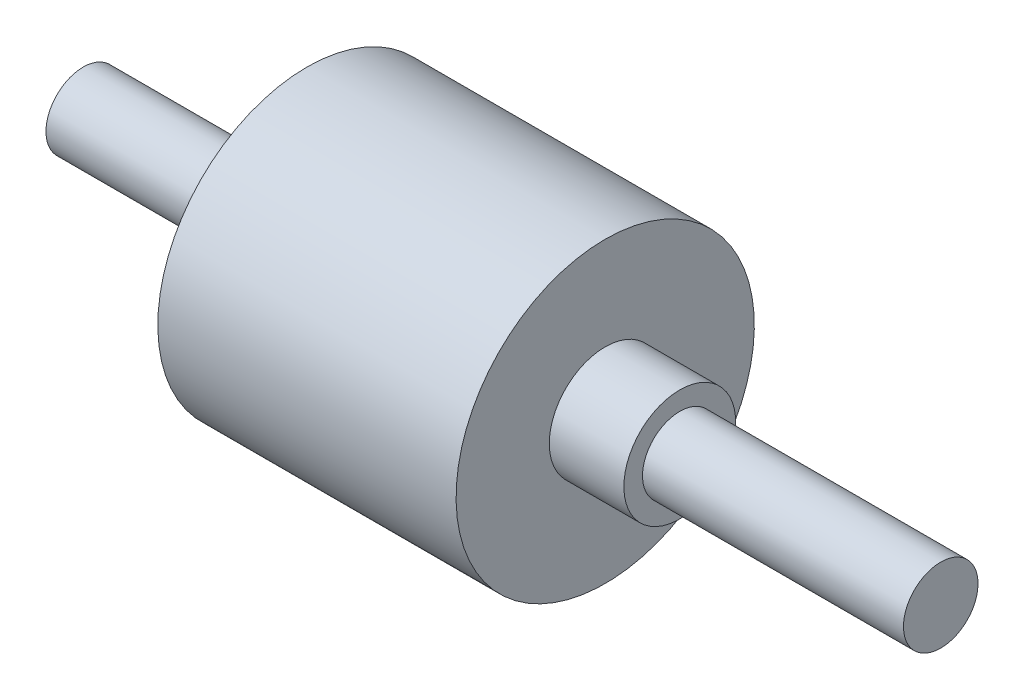
ISO-10303-21;
HEADER;
FILE_DESCRIPTION(('STEP AP214'),'2;1');
FILE_NAME('part.step','',(''),(''),'','','');
FILE_SCHEMA(('AUTOMOTIVE_DESIGN { 1 0 10303 214 1 1 1 1 }'));
ENDSEC;
DATA;
#1=APPLICATION_CONTEXT('core data for automotive mechanical design processes');
#2=APPLICATION_PROTOCOL_DEFINITION('international standard','automotive_design',2000,#1);
#3=PRODUCT_CONTEXT('',#1,'mechanical');
#4=PRODUCT('Part','Part','',(#3));
#5=PRODUCT_RELATED_PRODUCT_CATEGORY('part','',(#4));
#6=PRODUCT_DEFINITION_FORMATION('','',#4);
#7=PRODUCT_DEFINITION_CONTEXT('part definition',#1,'design');
#8=PRODUCT_DEFINITION('design','',#6,#7);
#9=PRODUCT_DEFINITION_SHAPE('','',#8);
#10=(LENGTH_UNIT() NAMED_UNIT(*) SI_UNIT(.MILLI.,.METRE.));
#11=(NAMED_UNIT(*) PLANE_ANGLE_UNIT() SI_UNIT($,.RADIAN.));
#12=(NAMED_UNIT(*) SI_UNIT($,.STERADIAN.) SOLID_ANGLE_UNIT());
#13=UNCERTAINTY_MEASURE_WITH_UNIT(LENGTH_MEASURE(1.E-05),#10,'distance_accuracy_value','');
#14=(GEOMETRIC_REPRESENTATION_CONTEXT(3) GLOBAL_UNCERTAINTY_ASSIGNED_CONTEXT((#13)) GLOBAL_UNIT_ASSIGNED_CONTEXT((#10,
#11,#12)) REPRESENTATION_CONTEXT('',''));
#15=CARTESIAN_POINT('',(0.,0.,0.));
#16=DIRECTION('',(0.,0.,1.));
#17=DIRECTION('',(1.,0.,0.));
#18=AXIS2_PLACEMENT_3D('',#15,#16,#17);
#19=CARTESIAN_POINT('',(57.5,5.,0.));
#20=DIRECTION('',(1.,0.,0.));
#21=DIRECTION('',(0.,1.,0.));
#22=AXIS2_PLACEMENT_3D('',#19,#20,#21);
#23=PLANE('',#22);
#24=CARTESIAN_POINT('',(57.5,0.,0.));
#25=DIRECTION('',(1.,0.,0.));
#26=DIRECTION('',(0.,1.,0.));
#27=AXIS2_PLACEMENT_3D('',#24,#25,#26);
#28=CIRCLE('',#27,4.99999999999998);
#29=CARTESIAN_POINT('',(57.5,5.,0.));
#30=VERTEX_POINT('',#29);
#31=EDGE_CURVE('E76',#30,#30,#28,.T.);
#32=ORIENTED_EDGE('',*,*,#31,.T.);
#33=EDGE_LOOP('',(#32));
#34=FACE_BOUND('',#33,.T.);
#35=ADVANCED_FACE('F41',(#34),#23,.T.);
#36=CARTESIAN_POINT('',(-57.5,0.,0.));
#37=DIRECTION('',(-1.,0.,0.));
#38=DIRECTION('',(0.,-1.,0.));
#39=AXIS2_PLACEMENT_3D('',#36,#37,#38);
#40=PLANE('',#39);
#41=CARTESIAN_POINT('',(-57.5,0.,0.));
#42=DIRECTION('',(1.,0.,0.));
#43=DIRECTION('',(0.,1.,0.));
#44=AXIS2_PLACEMENT_3D('',#41,#42,#43);
#45=CIRCLE('',#44,5.00000000000002);
#46=CARTESIAN_POINT('',(-57.5,5.,0.));
#47=VERTEX_POINT('',#46);
#48=EDGE_CURVE('E10',#47,#47,#45,.T.);
#49=ORIENTED_EDGE('',*,*,#48,.F.);
#50=EDGE_LOOP('',(#49));
#51=FACE_BOUND('',#50,.T.);
#52=ADVANCED_FACE('F94',(#51),#40,.T.);
#53=CARTESIAN_POINT('',(57.5,0.,0.));
#54=DIRECTION('',(1.,0.,0.));
#55=DIRECTION('',(0.,1.,0.));
#56=AXIS2_PLACEMENT_3D('',#53,#54,#55);
#57=CYLINDRICAL_SURFACE('',#56,5.00000000000001);
#58=ORIENTED_EDGE('',*,*,#48,.T.);
#59=EDGE_LOOP('',(#58));
#60=FACE_BOUND('',#59,.T.);
#61=CARTESIAN_POINT('',(-27.5,0.,0.));
#62=DIRECTION('',(1.,0.,0.));
#63=DIRECTION('',(0.,1.,0.));
#64=AXIS2_PLACEMENT_3D('',#61,#62,#63);
#65=CIRCLE('',#64,5.00000000000001);
#66=CARTESIAN_POINT('',(-27.5,5.,0.));
#67=VERTEX_POINT('',#66);
#68=EDGE_CURVE('E48',#67,#67,#65,.T.);
#69=ORIENTED_EDGE('',*,*,#68,.F.);
#70=EDGE_LOOP('',(#69));
#71=FACE_BOUND('',#70,.T.);
#72=ADVANCED_FACE('F98',(#60,#71),#57,.T.);
#73=CARTESIAN_POINT('',(-27.5,5.,0.));
#74=DIRECTION('',(-1.,0.,0.));
#75=DIRECTION('',(0.,-1.,0.));
#76=AXIS2_PLACEMENT_3D('',#73,#74,#75);
#77=PLANE('',#76);
#78=ORIENTED_EDGE('',*,*,#68,.T.);
#79=EDGE_LOOP('',(#78));
#80=FACE_BOUND('',#79,.T.);
#81=CARTESIAN_POINT('',(-27.5,0.,0.));
#82=DIRECTION('',(1.,0.,0.));
#83=DIRECTION('',(0.,1.,0.));
#84=AXIS2_PLACEMENT_3D('',#81,#82,#83);
#85=CIRCLE('',#84,20.);
#86=CARTESIAN_POINT('',(-27.5,20.,0.));
#87=VERTEX_POINT('',#86);
#88=EDGE_CURVE('E53',#87,#87,#85,.T.);
#89=ORIENTED_EDGE('',*,*,#88,.F.);
#90=EDGE_LOOP('',(#89));
#91=FACE_BOUND('',#90,.T.);
#92=ADVANCED_FACE('F103',(#80,#91),#77,.T.);
#93=CARTESIAN_POINT('',(57.5,0.,0.));
#94=DIRECTION('',(1.,0.,0.));
#95=DIRECTION('',(0.,1.,0.));
#96=AXIS2_PLACEMENT_3D('',#93,#94,#95);
#97=CYLINDRICAL_SURFACE('',#96,20.);
#98=ORIENTED_EDGE('',*,*,#88,.T.);
#99=EDGE_LOOP('',(#98));
#100=FACE_BOUND('',#99,.T.);
#101=CARTESIAN_POINT('',(12.5,0.,0.));
#102=DIRECTION('',(1.,0.,0.));
#103=DIRECTION('',(0.,1.,0.));
#104=AXIS2_PLACEMENT_3D('',#101,#102,#103);
#105=CIRCLE('',#104,20.);
#106=CARTESIAN_POINT('',(12.5,20.,0.));
#107=VERTEX_POINT('',#106);
#108=EDGE_CURVE('E58',#107,#107,#105,.T.);
#109=ORIENTED_EDGE('',*,*,#108,.F.);
#110=EDGE_LOOP('',(#109));
#111=FACE_BOUND('',#110,.T.);
#112=ADVANCED_FACE('F108',(#100,#111),#97,.T.);
#113=CARTESIAN_POINT('',(12.5,20.,0.));
#114=DIRECTION('',(1.,0.,0.));
#115=DIRECTION('',(0.,1.,0.));
#116=AXIS2_PLACEMENT_3D('',#113,#114,#115);
#117=PLANE('',#116);
#118=ORIENTED_EDGE('',*,*,#108,.T.);
#119=EDGE_LOOP('',(#118));
#120=FACE_BOUND('',#119,.T.);
#121=CARTESIAN_POINT('',(12.5,0.,0.));
#122=DIRECTION('',(1.,0.,0.));
#123=DIRECTION('',(0.,1.,0.));
#124=AXIS2_PLACEMENT_3D('',#121,#122,#123);
#125=CIRCLE('',#124,7.49999999999999);
#126=CARTESIAN_POINT('',(12.5,7.5,0.));
#127=VERTEX_POINT('',#126);
#128=EDGE_CURVE('E64',#127,#127,#125,.T.);
#129=ORIENTED_EDGE('',*,*,#128,.F.);
#130=EDGE_LOOP('',(#129));
#131=FACE_BOUND('',#130,.T.);
#132=ADVANCED_FACE('F111',(#120,#131),#117,.T.);
#133=CARTESIAN_POINT('',(57.5,0.,0.));
#134=DIRECTION('',(1.,0.,0.));
#135=DIRECTION('',(0.,1.,0.));
#136=AXIS2_PLACEMENT_3D('',#133,#134,#135);
#137=CYLINDRICAL_SURFACE('',#136,7.49999999999999);
#138=ORIENTED_EDGE('',*,*,#128,.T.);
#139=EDGE_LOOP('',(#138));
#140=FACE_BOUND('',#139,.T.);
#141=CARTESIAN_POINT('',(22.5,0.,0.));
#142=DIRECTION('',(1.,0.,0.));
#143=DIRECTION('',(0.,1.,0.));
#144=AXIS2_PLACEMENT_3D('',#141,#142,#143);
#145=CIRCLE('',#144,7.49999999999999);
#146=CARTESIAN_POINT('',(22.5,7.5,0.));
#147=VERTEX_POINT('',#146);
#148=EDGE_CURVE('E68',#147,#147,#145,.T.);
#149=ORIENTED_EDGE('',*,*,#148,.F.);
#150=EDGE_LOOP('',(#149));
#151=FACE_BOUND('',#150,.T.);
#152=ADVANCED_FACE('F90',(#140,#151),#137,.T.);
#153=CARTESIAN_POINT('',(22.5,7.5,0.));
#154=DIRECTION('',(1.,0.,0.));
#155=DIRECTION('',(0.,1.,0.));
#156=AXIS2_PLACEMENT_3D('',#153,#154,#155);
#157=PLANE('',#156);
#158=ORIENTED_EDGE('',*,*,#148,.T.);
#159=EDGE_LOOP('',(#158));
#160=FACE_BOUND('',#159,.T.);
#161=CARTESIAN_POINT('',(22.5,0.,0.));
#162=DIRECTION('',(1.,0.,0.));
#163=DIRECTION('',(0.,1.,0.));
#164=AXIS2_PLACEMENT_3D('',#161,#162,#163);
#165=CIRCLE('',#164,4.99999999999999);
#166=CARTESIAN_POINT('',(22.5,5.,0.));
#167=VERTEX_POINT('',#166);
#168=EDGE_CURVE('E72',#167,#167,#165,.T.);
#169=ORIENTED_EDGE('',*,*,#168,.F.);
#170=EDGE_LOOP('',(#169));
#171=FACE_BOUND('',#170,.T.);
#172=ADVANCED_FACE('F84',(#160,#171),#157,.T.);
#173=CARTESIAN_POINT('',(57.5,0.,0.));
#174=DIRECTION('',(1.,0.,0.));
#175=DIRECTION('',(0.,1.,0.));
#176=AXIS2_PLACEMENT_3D('',#173,#174,#175);
#177=CYLINDRICAL_SURFACE('',#176,4.99999999999998);
#178=ORIENTED_EDGE('',*,*,#168,.T.);
#179=EDGE_LOOP('',(#178));
#180=FACE_BOUND('',#179,.T.);
#181=ORIENTED_EDGE('',*,*,#31,.F.);
#182=EDGE_LOOP('',(#181));
#183=FACE_BOUND('',#182,.T.);
#184=ADVANCED_FACE('F82',(#180,#183),#177,.T.);
#185=CLOSED_SHELL('',(#35,#52,#72,#92,#112,#132,#152,#172,#184));
#186=MANIFOLD_SOLID_BREP('B2',#185);
#187=ADVANCED_BREP_SHAPE_REPRESENTATION('',(#18,#186),#14);
#188=SHAPE_DEFINITION_REPRESENTATION(#9,#187);
ENDSEC;
END-ISO-10303-21;
